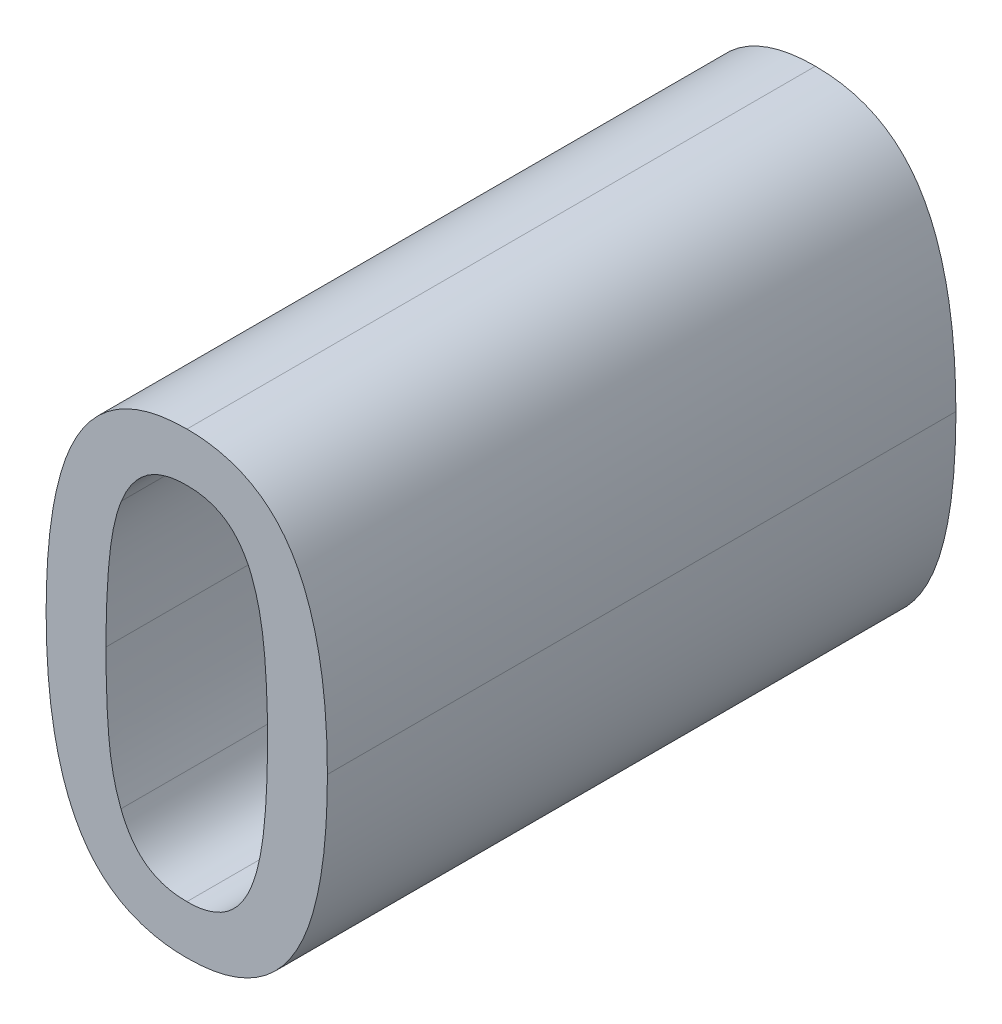
ISO-10303-21;
HEADER;
FILE_DESCRIPTION(('STEP AP214'),'2;1');
FILE_NAME('part.step','',(''),(''),'','','');
FILE_SCHEMA(('AUTOMOTIVE_DESIGN { 1 0 10303 214 1 1 1 1 }'));
ENDSEC;
DATA;
#1=APPLICATION_CONTEXT('core data for automotive mechanical design processes');
#2=APPLICATION_PROTOCOL_DEFINITION('international standard','automotive_design',2000,#1);
#3=PRODUCT_CONTEXT('',#1,'mechanical');
#4=PRODUCT('Part','Part','',(#3));
#5=PRODUCT_RELATED_PRODUCT_CATEGORY('part','',(#4));
#6=PRODUCT_DEFINITION_FORMATION('','',#4);
#7=PRODUCT_DEFINITION_CONTEXT('part definition',#1,'design');
#8=PRODUCT_DEFINITION('design','',#6,#7);
#9=PRODUCT_DEFINITION_SHAPE('','',#8);
#10=(LENGTH_UNIT() NAMED_UNIT(*) SI_UNIT(.MILLI.,.METRE.));
#11=(NAMED_UNIT(*) PLANE_ANGLE_UNIT() SI_UNIT($,.RADIAN.));
#12=(NAMED_UNIT(*) SI_UNIT($,.STERADIAN.) SOLID_ANGLE_UNIT());
#13=UNCERTAINTY_MEASURE_WITH_UNIT(LENGTH_MEASURE(1.E-05),#10,'distance_accuracy_value','');
#14=(GEOMETRIC_REPRESENTATION_CONTEXT(3) GLOBAL_UNCERTAINTY_ASSIGNED_CONTEXT((#13)) GLOBAL_UNIT_ASSIGNED_CONTEXT((#10,
#11,#12)) REPRESENTATION_CONTEXT('',''));
#15=CARTESIAN_POINT('',(0.,0.,0.));
#16=DIRECTION('',(0.,0.,1.));
#17=DIRECTION('',(1.,0.,0.));
#18=AXIS2_PLACEMENT_3D('',#15,#16,#17);
#19=CARTESIAN_POINT('',(0.909056419877411,-0.565618001030964,0.));
#20=CARTESIAN_POINT('',(0.909056419877411,-0.565618001030964,0.1));
#21=CARTESIAN_POINT('',(0.912913794388695,-0.565618001030964,0.));
#22=CARTESIAN_POINT('',(0.912913794388695,-0.565618001030964,0.1));
#23=CARTESIAN_POINT('',(0.917962416910818,-0.561930804806941,0.));
#24=CARTESIAN_POINT('',(0.917962416910818,-0.561930804806941,0.1));
#25=CARTESIAN_POINT('',(0.919380569304673,-0.558243608582919,0.));
#26=CARTESIAN_POINT('',(0.919380569304673,-0.558243608582919,0.1));
#27=B_SPLINE_SURFACE_WITH_KNOTS('',2,1,((#19,#20),(#21,#22),(#23,#24),(#25,#26)),.UNSPECIFIED.,
.F.,.F.,.F.,(3,1,3),(2,2),(0.,0.5,1.),(0.,1.),.UNSPECIFIED.);
#28=CARTESIAN_POINT('',(0.909056419877411,-0.565618001030964,0.));
#29=CARTESIAN_POINT('',(0.910267212618054,-0.56564585985134,0.));
#30=CARTESIAN_POINT('',(0.911517809576005,-0.565486872117512,0.));
#31=CARTESIAN_POINT('',(0.913610150242879,-0.564840726155343,0.));
#32=CARTESIAN_POINT('',(0.914479979941994,-0.564436955597001,0.));
#33=CARTESIAN_POINT('',(0.915996559710738,-0.563394993681676,0.));
#34=CARTESIAN_POINT('',(0.916652559078856,-0.562770086455742,0.));
#35=CARTESIAN_POINT('',(0.918164049922598,-0.560929138453409,0.));
#36=CARTESIAN_POINT('',(0.918882298702573,-0.559589516250247,0.));
#37=CARTESIAN_POINT('',(0.919380569609504,-0.558243607790358,0.));
#38=B_SPLINE_CURVE_WITH_KNOTS('',3,(#28,#29,#30,#31,#32,#33,#34,#35,#36,#37),.UNSPECIFIED.,.F.,
.F.,(4,2,2,2,4),(0.,0.00367627129055633,0.00651160113731828,0.00919946866098172,
0.0135916049079163),.UNSPECIFIED.);
#39=CARTESIAN_POINT('',(0.909056419877411,-0.565618001030964,0.));
#40=VERTEX_POINT('',#39);
#41=CARTESIAN_POINT('',(0.919380569304673,-0.558243608582919,0.));
#42=VERTEX_POINT('',#41);
#43=EDGE_CURVE('E11',#40,#42,#38,.T.);
#44=DIRECTION('',(0.,0.,1.));
#45=VECTOR('',#44,1.);
#46=CARTESIAN_POINT('',(0.909056419877411,-0.565618001030964,0.));
#47=LINE('',#46,#45);
#48=CARTESIAN_POINT('',(0.909056419877411,-0.565618001030964,0.1));
#49=VERTEX_POINT('',#48);
#50=EDGE_CURVE('E280',#40,#49,#47,.T.);
#51=CARTESIAN_POINT('',(0.919380569304673,-0.558243608582919,0.1));
#52=CARTESIAN_POINT('',(0.91892115176633,-0.5594846153821,0.1));
#53=CARTESIAN_POINT('',(0.918274116769871,-0.560720767791728,0.1));
#54=CARTESIAN_POINT('',(0.916816306298207,-0.562610601739669,0.1));
#55=CARTESIAN_POINT('',(0.916087707739882,-0.563332579650054,0.1));
#56=CARTESIAN_POINT('',(0.914518876125207,-0.56441007702488,0.1));
#57=CARTESIAN_POINT('',(0.913701486035512,-0.564798453941822,0.1));
#58=CARTESIAN_POINT('',(0.911621418659629,-0.56547445048266,0.1));
#59=CARTESIAN_POINT('',(0.91031785035809,-0.5656478711897,0.1));
#60=CARTESIAN_POINT('',(0.909056418304556,-0.565618001030964,0.1));
#61=B_SPLINE_CURVE_WITH_KNOTS('',3,(#51,#52,#53,#54,#55,#56,#57,#58,#59,#60),.UNSPECIFIED.,.F.,
.F.,(4,2,2,2,4),(0.,0.00405272402912058,0.00708561009471911,0.00976571674475608,
0.01359247812981),.UNSPECIFIED.);
#62=CARTESIAN_POINT('',(0.919380569304673,-0.558243608582919,0.1));
#63=VERTEX_POINT('',#62);
#64=EDGE_CURVE('E286',#63,#49,#61,.T.);
#65=DIRECTION('',(0.,0.,1.));
#66=VECTOR('',#65,1.);
#67=CARTESIAN_POINT('',(0.919380569304673,-0.558243608582919,0.));
#68=LINE('',#67,#66);
#69=EDGE_CURVE('E301',#42,#63,#68,.T.);
#70=ORIENTED_EDGE('',*,*,#43,.F.);
#71=ORIENTED_EDGE('',*,*,#50,.T.);
#72=ORIENTED_EDGE('',*,*,#64,.F.);
#73=ORIENTED_EDGE('',*,*,#69,.F.);
#74=EDGE_LOOP('',(#70,#71,#72,#73));
#75=FACE_BOUND('',#74,.T.);
#76=ADVANCED_FACE('F17',(#75),#27,.F.);
#77=CARTESIAN_POINT('',(0.898562092162886,-0.558073430295657,0.));
#78=CARTESIAN_POINT('',(0.898562092162886,-0.558073430295657,0.1));
#79=CARTESIAN_POINT('',(0.899923518460986,-0.561703900423925,0.));
#80=CARTESIAN_POINT('',(0.899923518460986,-0.561703900423925,0.1));
#81=CARTESIAN_POINT('',(0.904972140983109,-0.565618001030964,0.));
#82=CARTESIAN_POINT('',(0.904972140983109,-0.565618001030964,0.1));
#83=CARTESIAN_POINT('',(0.909056419877411,-0.565618001030964,0.));
#84=CARTESIAN_POINT('',(0.909056419877411,-0.565618001030964,0.1));
#85=B_SPLINE_SURFACE_WITH_KNOTS('',2,1,((#77,#78),(#79,#80),(#81,#82),(#83,#84)),.UNSPECIFIED.,
.F.,.F.,.F.,(3,1,3),(2,2),(0.,0.5,1.),(0.,1.),.UNSPECIFIED.);
#86=CARTESIAN_POINT('',(0.898562092162886,-0.558073430295657,0.));
#87=CARTESIAN_POINT('',(0.899032119665135,-0.559339515165096,0.));
#88=CARTESIAN_POINT('',(0.899688209514549,-0.560611801933779,0.));
#89=CARTESIAN_POINT('',(0.901181035793648,-0.562574355789389,0.));
#90=CARTESIAN_POINT('',(0.901937196437352,-0.563331055238074,0.));
#91=CARTESIAN_POINT('',(0.903515654761632,-0.564407176989134,0.));
#92=CARTESIAN_POINT('',(0.904299921514108,-0.564781559252794,0.));
#93=CARTESIAN_POINT('',(0.906389896997623,-0.565475146922471,0.));
#94=CARTESIAN_POINT('',(0.907747579413977,-0.565654104300062,0.));
#95=CARTESIAN_POINT('',(0.909056420833795,-0.565618001030964,0.));
#96=B_SPLINE_CURVE_WITH_KNOTS('',3,(#86,#87,#88,#89,#90,#91,#92,#93,#94,#95),.UNSPECIFIED.,.F.,
.F.,(4,2,2,2,4),(0.,0.0041518860493181,0.00731210362130394,0.00988844895489868,
0.0138631959958877),.UNSPECIFIED.);
#97=CARTESIAN_POINT('',(0.898562092162886,-0.558073430295657,0.));
#98=VERTEX_POINT('',#97);
#99=EDGE_CURVE('E32',#98,#40,#96,.T.);
#100=DIRECTION('',(0.,0.,1.));
#101=VECTOR('',#100,1.);
#102=CARTESIAN_POINT('',(0.898562092162886,-0.558073430295657,0.));
#103=LINE('',#102,#101);
#104=CARTESIAN_POINT('',(0.898562092162886,-0.558073430295657,0.1));
#105=VERTEX_POINT('',#104);
#106=EDGE_CURVE('E283',#98,#105,#103,.T.);
#107=CARTESIAN_POINT('',(0.909056419877411,-0.565618001030964,0.1));
#108=CARTESIAN_POINT('',(0.907832082284102,-0.565644099804821,0.1));
#109=CARTESIAN_POINT('',(0.906563208104373,-0.565492181139306,0.1));
#110=CARTESIAN_POINT('',(0.904470430436798,-0.564858879467396,0.1));
#111=CARTESIAN_POINT('',(0.903615282422973,-0.564470808694516,0.1));
#112=CARTESIAN_POINT('',(0.902147112098235,-0.56347849658322,0.1));
#113=CARTESIAN_POINT('',(0.901519381096472,-0.56289635787521,0.1));
#114=CARTESIAN_POINT('',(0.900273134187953,-0.561449758754844,0.1));
#115=CARTESIAN_POINT('',(0.899696771444867,-0.560551120310507,0.1));
#116=CARTESIAN_POINT('',(0.898975327909033,-0.559104501374176,0.1));
#117=CARTESIAN_POINT('',(0.898755405791218,-0.558592608690898,0.1));
#118=CARTESIAN_POINT('',(0.898562092162886,-0.558073430295657,0.1));
#119=B_SPLINE_CURVE_WITH_KNOTS('',3,(#107,#108,#109,#110,#111,#112,#113,#114,#115,#116,#117,
#118),.UNSPECIFIED.,.F.,.F.,(4,2,2,2,2,4),(0.,0.0037237069415342,0.00650317580725846,
0.00903732472947941,0.0122098264119718,0.013876051996284),.UNSPECIFIED.);
#120=EDGE_CURVE('E297',#49,#105,#119,.T.);
#121=ORIENTED_EDGE('',*,*,#99,.F.);
#122=ORIENTED_EDGE('',*,*,#106,.T.);
#123=ORIENTED_EDGE('',*,*,#120,.F.);
#124=ORIENTED_EDGE('',*,*,#50,.F.);
#125=EDGE_LOOP('',(#121,#122,#123,#124));
#126=FACE_BOUND('',#125,.T.);
#127=ADVANCED_FACE('F188',(#126),#85,.F.);
#128=CARTESIAN_POINT('',(0.89617959614121,-0.536971322675099,0.));
#129=CARTESIAN_POINT('',(0.89617959614121,-0.536971322675099,0.1));
#130=CARTESIAN_POINT('',(0.89617959614121,-0.544345715123143,0.));
#131=CARTESIAN_POINT('',(0.89617959614121,-0.544345715123143,0.1));
#132=CARTESIAN_POINT('',(0.897087213673277,-0.554216055784372,0.));
#133=CARTESIAN_POINT('',(0.897087213673277,-0.554216055784372,0.1));
#134=CARTESIAN_POINT('',(0.898562092162886,-0.558073430295657,0.));
#135=CARTESIAN_POINT('',(0.898562092162886,-0.558073430295657,0.1));
#136=B_SPLINE_SURFACE_WITH_KNOTS('',2,1,((#128,#129),(#130,#131),(#132,#133),(#134,#135)),
.UNSPECIFIED.,.F.,.F.,.F.,(3,1,3),(2,2),(0.,0.5,1.),(0.,1.),.UNSPECIFIED.);
#137=CARTESIAN_POINT('',(0.89617959614121,-0.536971322675099,0.));
#138=CARTESIAN_POINT('',(0.896194873233438,-0.53884873799181,0.));
#139=CARTESIAN_POINT('',(0.896207648918116,-0.540725879504751,0.));
#140=CARTESIAN_POINT('',(0.896304263461827,-0.544498327181554,0.));
#141=CARTESIAN_POINT('',(0.896388875830726,-0.546393608175672,0.));
#142=CARTESIAN_POINT('',(0.896718737311729,-0.55030462973275,0.));
#143=CARTESIAN_POINT('',(0.896974192968156,-0.552320088072961,0.));
#144=CARTESIAN_POINT('',(0.897710297002586,-0.555574594598394,0.));
#145=CARTESIAN_POINT('',(0.898081326156949,-0.556839262163063,0.));
#146=CARTESIAN_POINT('',(0.898562092162886,-0.558073430295657,0.));
#147=B_SPLINE_CURVE_WITH_KNOTS('',3,(#137,#138,#139,#140,#141,#142,#143,#144,#145,#146),
.UNSPECIFIED.,.F.,.F.,(4,2,2,2,4),(0.,0.00563106489923128,0.0113235433406714,0.0173907006261486,
0.021341740246364),.UNSPECIFIED.);
#148=CARTESIAN_POINT('',(0.89617959614121,-0.536971322675099,0.));
#149=VERTEX_POINT('',#148);
#150=EDGE_CURVE('E269',#149,#98,#147,.T.);
#151=DIRECTION('',(0.,0.,1.));
#152=VECTOR('',#151,1.);
#153=CARTESIAN_POINT('',(0.89617959614121,-0.536971322675099,0.));
#154=LINE('',#153,#152);
#155=CARTESIAN_POINT('',(0.89617959614121,-0.536971322675099,0.1));
#156=VERTEX_POINT('',#155);
#157=EDGE_CURVE('E295',#149,#156,#154,.T.);
#158=CARTESIAN_POINT('',(0.898562091555877,-0.558073428708094,0.1));
#159=CARTESIAN_POINT('',(0.897619885435836,-0.555713730085074,0.1));
#160=CARTESIAN_POINT('',(0.897108009175026,-0.553267049583408,0.1));
#161=CARTESIAN_POINT('',(0.896648783359491,-0.549582602822717,0.1));
#162=CARTESIAN_POINT('',(0.89654655609819,-0.548368076000775,0.1));
#163=CARTESIAN_POINT('',(0.896385762815465,-0.545934132954986,0.1));
#164=CARTESIAN_POINT('',(0.896327323103632,-0.544714712710028,0.1));
#165=CARTESIAN_POINT('',(0.896246020038301,-0.542405808700509,0.1));
#166=CARTESIAN_POINT('',(0.896220005459778,-0.541316460830288,0.1));
#167=CARTESIAN_POINT('',(0.896187034221754,-0.539141772819599,0.1));
#168=CARTESIAN_POINT('',(0.896180002550657,-0.53805643387904,0.1));
#169=CARTESIAN_POINT('',(0.89617959614121,-0.536971319377238,0.1));
#170=B_SPLINE_CURVE_WITH_KNOTS('',3,(#158,#159,#160,#161,#162,#163,#164,#165,#166,#167,#168,
#169),.UNSPECIFIED.,.F.,.F.,(4,2,2,2,2,4),(0.,0.00749383186341079,0.0111460824870698,
0.014808828259514,0.0180774928710397,0.0213332222076608),.UNSPECIFIED.);
#171=EDGE_CURVE('E313',#105,#156,#170,.T.);
#172=ORIENTED_EDGE('',*,*,#150,.F.);
#173=ORIENTED_EDGE('',*,*,#157,.T.);
#174=ORIENTED_EDGE('',*,*,#171,.F.);
#175=ORIENTED_EDGE('',*,*,#106,.F.);
#176=EDGE_LOOP('',(#172,#173,#174,#175));
#177=FACE_BOUND('',#176,.T.);
#178=ADVANCED_FACE('F184',(#177),#136,.F.);
#179=CARTESIAN_POINT('',(0.89861881825864,-0.515642310671524,0.));
#180=CARTESIAN_POINT('',(0.89861881825864,-0.515642310671524,0.1));
#181=CARTESIAN_POINT('',(0.897200665864785,-0.519216054704038,0.));
#182=CARTESIAN_POINT('',(0.897200665864785,-0.519216054704038,0.1));
#183=CARTESIAN_POINT('',(0.89617959614121,-0.530107465088842,0.));
#184=CARTESIAN_POINT('',(0.89617959614121,-0.530107465088842,0.1));
#185=CARTESIAN_POINT('',(0.89617959614121,-0.536971322675099,0.));
#186=CARTESIAN_POINT('',(0.89617959614121,-0.536971322675099,0.1));
#187=B_SPLINE_SURFACE_WITH_KNOTS('',2,1,((#179,#180),(#181,#182),(#183,#184),(#185,#186)),
.UNSPECIFIED.,.F.,.F.,.F.,(3,1,3),(2,2),(0.,0.5,1.),(0.,1.),.UNSPECIFIED.);
#188=CARTESIAN_POINT('',(0.89861881825864,-0.515642310671524,0.));
#189=CARTESIAN_POINT('',(0.898031046306757,-0.517148743595055,0.));
#190=CARTESIAN_POINT('',(0.897614147405343,-0.518699427183717,0.));
#191=CARTESIAN_POINT('',(0.89702101181466,-0.521738770929132,0.));
#192=CARTESIAN_POINT('',(0.896830234607591,-0.523224394187015,0.));
#193=CARTESIAN_POINT('',(0.896539833780557,-0.526207892924964,0.));
#194=CARTESIAN_POINT('',(0.896440637628606,-0.527705793263702,0.));
#195=CARTESIAN_POINT('',(0.896300351822083,-0.530502822811018,0.));
#196=CARTESIAN_POINT('',(0.896253243270168,-0.531801601963522,0.));
#197=CARTESIAN_POINT('',(0.896192439521179,-0.534390781325779,0.));
#198=CARTESIAN_POINT('',(0.896178510854828,-0.535681175979652,0.));
#199=CARTESIAN_POINT('',(0.89617959614121,-0.536971323085966,0.));
#200=B_SPLINE_CURVE_WITH_KNOTS('',3,(#188,#189,#190,#191,#192,#193,#194,#195,#196,#197,#198,
#199),.UNSPECIFIED.,.F.,.F.,(4,2,2,2,2,4),(0.,0.00481294322784697,0.0092959021811463,
0.0137996817476929,0.0176979814485385,0.0215687687894537),.UNSPECIFIED.);
#201=CARTESIAN_POINT('',(0.89861881825864,-0.515642310671524,0.));
#202=VERTEX_POINT('',#201);
#203=EDGE_CURVE('E261',#202,#149,#200,.T.);
#204=DIRECTION('',(0.,0.,1.));
#205=VECTOR('',#204,1.);
#206=CARTESIAN_POINT('',(0.89861881825864,-0.515642310671524,0.));
#207=LINE('',#206,#205);
#208=CARTESIAN_POINT('',(0.89861881825864,-0.515642310671524,0.1));
#209=VERTEX_POINT('',#208);
#210=EDGE_CURVE('E311',#202,#209,#207,.T.);
#211=CARTESIAN_POINT('',(0.89617959614121,-0.536971322675099,0.1));
#212=CARTESIAN_POINT('',(0.896194004259372,-0.534933190081441,0.1));
#213=CARTESIAN_POINT('',(0.896219468852487,-0.532899669430967,0.1));
#214=CARTESIAN_POINT('',(0.89636388344471,-0.528798250264312,0.1));
#215=CARTESIAN_POINT('',(0.896484583671533,-0.526730424946702,0.1));
#216=CARTESIAN_POINT('',(0.89694242620624,-0.522122615916438,0.1));
#217=CARTESIAN_POINT('',(0.897322550979549,-0.51958220680589,0.1));
#218=CARTESIAN_POINT('',(0.898245068639878,-0.516646441570645,0.1));
#219=CARTESIAN_POINT('',(0.898422306915657,-0.516141294179793,0.1));
#220=CARTESIAN_POINT('',(0.898618818079457,-0.515642311123066,0.1));
#221=B_SPLINE_CURVE_WITH_KNOTS('',3,(#211,#212,#213,#214,#215,#216,#217,#218,#219,#220),
.UNSPECIFIED.,.F.,.F.,(4,2,2,2,4),(0.,0.00610426386682868,0.012323400198396,0.0199569620334136,
0.0215627429597292),.UNSPECIFIED.);
#222=EDGE_CURVE('E325',#156,#209,#221,.T.);
#223=ORIENTED_EDGE('',*,*,#203,.F.);
#224=ORIENTED_EDGE('',*,*,#210,.T.);
#225=ORIENTED_EDGE('',*,*,#222,.F.);
#226=ORIENTED_EDGE('',*,*,#157,.F.);
#227=EDGE_LOOP('',(#223,#224,#225,#226));
#228=FACE_BOUND('',#227,.T.);
#229=ADVANCED_FACE('F333',(#228),#187,.F.);
#230=CARTESIAN_POINT('',(0.909056419877411,-0.508267918223479,0.));
#231=CARTESIAN_POINT('',(0.909056419877411,-0.508267918223479,0.1));
#232=CARTESIAN_POINT('',(0.905142319270372,-0.508267918223479,0.));
#233=CARTESIAN_POINT('',(0.905142319270372,-0.508267918223479,0.1));
#234=CARTESIAN_POINT('',(0.900093696748249,-0.511955114447502,0.));
#235=CARTESIAN_POINT('',(0.900093696748249,-0.511955114447502,0.1));
#236=CARTESIAN_POINT('',(0.89861881825864,-0.515642310671524,0.));
#237=CARTESIAN_POINT('',(0.89861881825864,-0.515642310671524,0.1));
#238=B_SPLINE_SURFACE_WITH_KNOTS('',2,1,((#230,#231),(#232,#233),(#234,#235),(#236,#237)),
.UNSPECIFIED.,.F.,.F.,.F.,(3,1,3),(2,2),(0.,0.5,1.),(0.,1.),.UNSPECIFIED.);
#239=CARTESIAN_POINT('',(0.909056419877411,-0.508267918223479,0.));
#240=CARTESIAN_POINT('',(0.907832883226709,-0.508239306336636,0.));
#241=CARTESIAN_POINT('',(0.906566526566882,-0.508397043854983,0.));
#242=CARTESIAN_POINT('',(0.904460776866591,-0.509042664637653,0.));
#243=CARTESIAN_POINT('',(0.903591741269283,-0.509442482814913,0.));
#244=CARTESIAN_POINT('',(0.902082481450094,-0.510471210344641,0.));
#245=CARTESIAN_POINT('',(0.901431479885625,-0.511084535821852,0.));
#246=CARTESIAN_POINT('',(0.899893132179646,-0.512924835247913,0.));
#247=CARTESIAN_POINT('',(0.899149255846495,-0.514284405438731,0.));
#248=CARTESIAN_POINT('',(0.898618817799568,-0.515642311819204,0.));
#249=B_SPLINE_CURVE_WITH_KNOTS('',3,(#239,#240,#241,#242,#243,#244,#245,#246,#247,#248),
.UNSPECIFIED.,.F.,.F.,(4,2,2,2,4),(0.,0.00371911329056871,0.00654798191926362,
0.00920305248145293,0.0136764398086563),.UNSPECIFIED.);
#250=CARTESIAN_POINT('',(0.909056419877411,-0.508267918223479,0.));
#251=VERTEX_POINT('',#250);
#252=EDGE_CURVE('E252',#251,#202,#249,.T.);
#253=DIRECTION('',(0.,0.,1.));
#254=VECTOR('',#253,1.);
#255=CARTESIAN_POINT('',(0.909056419877411,-0.508267918223479,0.));
#256=LINE('',#255,#254);
#257=CARTESIAN_POINT('',(0.909056419877411,-0.508267918223479,0.1));
#258=VERTEX_POINT('',#257);
#259=EDGE_CURVE('E323',#251,#258,#256,.T.);
#260=CARTESIAN_POINT('',(0.89861881825864,-0.515642310671524,0.1));
#261=CARTESIAN_POINT('',(0.899107737773357,-0.514384539385591,0.1));
#262=CARTESIAN_POINT('',(0.899783016327358,-0.513125930253331,0.1));
#263=CARTESIAN_POINT('',(0.901286941544007,-0.511219034021222,0.1));
#264=CARTESIAN_POINT('',(0.902029592040893,-0.51049718749248,0.1));
#265=CARTESIAN_POINT('',(0.903613006585649,-0.509436782151373,0.1));
#266=CARTESIAN_POINT('',(0.904428019299753,-0.509060298540741,0.1));
#267=CARTESIAN_POINT('',(0.906502636192756,-0.508405274531867,0.1));
#268=CARTESIAN_POINT('',(0.907801884146269,-0.508239824841691,0.1));
#269=CARTESIAN_POINT('',(0.909056422085536,-0.508267918223479,0.1));
#270=B_SPLINE_CURVE_WITH_KNOTS('',3,(#260,#261,#262,#263,#264,#265,#266,#267,#268,#269),
.UNSPECIFIED.,.F.,.F.,(4,2,2,2,4),(0.,0.00414363781747205,0.00720606109413408,
0.00986569948818214,0.0136775556327739),.UNSPECIFIED.);
#271=EDGE_CURVE('E536',#209,#258,#270,.T.);
#272=ORIENTED_EDGE('',*,*,#252,.F.);
#273=ORIENTED_EDGE('',*,*,#259,.T.);
#274=ORIENTED_EDGE('',*,*,#271,.F.);
#275=ORIENTED_EDGE('',*,*,#210,.F.);
#276=EDGE_LOOP('',(#272,#273,#274,#275));
#277=FACE_BOUND('',#276,.T.);
#278=ADVANCED_FACE('F338',(#277),#238,.F.);
#279=CARTESIAN_POINT('',(0.919323843208919,-0.515528858480016,0.));
#280=CARTESIAN_POINT('',(0.919323843208919,-0.515528858480016,0.1));
#281=CARTESIAN_POINT('',(0.917905690815064,-0.511955114447502,0.));
#282=CARTESIAN_POINT('',(0.917905690815064,-0.511955114447502,0.1));
#283=CARTESIAN_POINT('',(0.91297052048445,-0.508267918223479,0.));
#284=CARTESIAN_POINT('',(0.91297052048445,-0.508267918223479,0.1));
#285=CARTESIAN_POINT('',(0.909056419877411,-0.508267918223479,0.));
#286=CARTESIAN_POINT('',(0.909056419877411,-0.508267918223479,0.1));
#287=B_SPLINE_SURFACE_WITH_KNOTS('',2,1,((#279,#280),(#281,#282),(#283,#284),(#285,#286)),
.UNSPECIFIED.,.F.,.F.,.F.,(3,1,3),(2,2),(0.,0.5,1.),(0.,1.),.UNSPECIFIED.);
#288=CARTESIAN_POINT('',(0.919323843208919,-0.515528858480016,0.));
#289=CARTESIAN_POINT('',(0.918841424255359,-0.514290821503638,0.));
#290=CARTESIAN_POINT('',(0.918177009157526,-0.513048195557504,0.));
#291=CARTESIAN_POINT('',(0.916691897149138,-0.511159017303144,0.));
#292=CARTESIAN_POINT('',(0.915954513674292,-0.51044128791765,0.));
#293=CARTESIAN_POINT('',(0.914402092269571,-0.509407363334264,0.));
#294=CARTESIAN_POINT('',(0.913617874990826,-0.509045562826433,0.));
#295=CARTESIAN_POINT('',(0.911587403907191,-0.508401412966769,0.));
#296=CARTESIAN_POINT('',(0.910298773694492,-0.508238661104177,0.));
#297=CARTESIAN_POINT('',(0.909056417731781,-0.508267918223479,0.));
#298=B_SPLINE_CURVE_WITH_KNOTS('',3,(#288,#289,#290,#291,#292,#293,#294,#295,#296,#297),
.UNSPECIFIED.,.F.,.F.,(4,2,2,2,4),(0.,0.00408557681685786,0.00712720430449132,
0.00968685410316085,0.0134637097217617),.UNSPECIFIED.);
#299=CARTESIAN_POINT('',(0.919323843208919,-0.515528858480015,0.));
#300=VERTEX_POINT('',#299);
#301=EDGE_CURVE('E242',#300,#251,#298,.T.);
#302=DIRECTION('',(0.,0.,1.));
#303=VECTOR('',#302,1.);
#304=CARTESIAN_POINT('',(0.919323843208919,-0.515528858480015,0.));
#305=LINE('',#304,#303);
#306=CARTESIAN_POINT('',(0.919323843208919,-0.515528858480015,0.1));
#307=VERTEX_POINT('',#306);
#308=EDGE_CURVE('E542',#300,#307,#305,.T.);
#309=CARTESIAN_POINT('',(0.909056419877411,-0.508267918223479,0.1));
#310=CARTESIAN_POINT('',(0.910259154175548,-0.50824185010978,0.1));
#311=CARTESIAN_POINT('',(0.911503862700689,-0.508392475134528,0.1));
#312=CARTESIAN_POINT('',(0.913561740690884,-0.509017413826974,0.1));
#313=CARTESIAN_POINT('',(0.91440508437197,-0.509401566835123,0.1));
#314=CARTESIAN_POINT('',(0.915861575069871,-0.510387804708538,0.1));
#315=CARTESIAN_POINT('',(0.916487474386578,-0.51097075545736,0.1));
#316=CARTESIAN_POINT('',(0.917729066716048,-0.512424410672821,0.1));
#317=CARTESIAN_POINT('',(0.918300559597565,-0.513330555757778,0.1));
#318=CARTESIAN_POINT('',(0.918973747107039,-0.514691378746413,0.1));
#319=CARTESIAN_POINT('',(0.919157166041113,-0.515107765746901,0.1));
#320=CARTESIAN_POINT('',(0.919323843363009,-0.515528858868323,0.1));
#321=B_SPLINE_CURVE_WITH_KNOTS('',3,(#309,#310,#311,#312,#313,#314,#315,#316,#317,#318,#319,
#320),.UNSPECIFIED.,.F.,.F.,(4,2,2,2,2,4),(0.,0.00365494250347632,0.00639775786631591,
0.00892862720587757,0.0121117353200126,0.0134738121228435),.UNSPECIFIED.);
#322=EDGE_CURVE('E549',#258,#307,#321,.T.);
#323=ORIENTED_EDGE('',*,*,#301,.F.);
#324=ORIENTED_EDGE('',*,*,#308,.T.);
#325=ORIENTED_EDGE('',*,*,#322,.F.);
#326=ORIENTED_EDGE('',*,*,#259,.F.);
#327=EDGE_LOOP('',(#323,#324,#325,#326));
#328=FACE_BOUND('',#327,.T.);
#329=ADVANCED_FACE('F350',(#328),#287,.F.);
#330=CARTESIAN_POINT('',(0.921876517517857,-0.536914596579344,0.));
#331=CARTESIAN_POINT('',(0.921876517517857,-0.536914596579344,0.1));
#332=CARTESIAN_POINT('',(0.921876517517857,-0.529710382418563,0.));
#333=CARTESIAN_POINT('',(0.921876517517857,-0.529710382418563,0.1));
#334=CARTESIAN_POINT('',(0.920741995602773,-0.519102602512529,0.));
#335=CARTESIAN_POINT('',(0.920741995602773,-0.519102602512529,0.1));
#336=CARTESIAN_POINT('',(0.919323843208919,-0.515528858480016,0.));
#337=CARTESIAN_POINT('',(0.919323843208919,-0.515528858480016,0.1));
#338=B_SPLINE_SURFACE_WITH_KNOTS('',2,1,((#330,#331),(#332,#333),(#334,#335),(#336,#337)),
.UNSPECIFIED.,.F.,.F.,.F.,(3,1,3),(2,2),(0.,0.5,1.),(0.,1.),.UNSPECIFIED.);
#339=CARTESIAN_POINT('',(0.921876517517857,-0.536914596579344,0.));
#340=CARTESIAN_POINT('',(0.921862699575506,-0.534819204641769,0.));
#341=CARTESIAN_POINT('',(0.921835618889062,-0.532721164042988,0.));
#342=CARTESIAN_POINT('',(0.921672824934347,-0.528548454955608,0.));
#343=CARTESIAN_POINT('',(0.921538066634549,-0.526473742881887,0.));
#344=CARTESIAN_POINT('',(0.921142509484469,-0.522899968056074,0.));
#345=CARTESIAN_POINT('',(0.920925812676562,-0.521397406440382,0.));
#346=CARTESIAN_POINT('',(0.920296792973233,-0.518426036426168,0.));
#347=CARTESIAN_POINT('',(0.91988322733535,-0.516957505486398,0.));
#348=CARTESIAN_POINT('',(0.919323843208919,-0.515528858480016,0.));
#349=B_SPLINE_CURVE_WITH_KNOTS('',3,(#339,#340,#341,#342,#343,#344,#345,#346,#347,#348),
.UNSPECIFIED.,.F.,.F.,(4,2,2,2,4),(0.,0.00629017370473222,0.0125251723313668,0.0170689748382148,
0.0216418485253573),.UNSPECIFIED.);
#350=CARTESIAN_POINT('',(0.921876517517857,-0.536914596579344,0.));
#351=VERTEX_POINT('',#350);
#352=EDGE_CURVE('E232',#351,#300,#349,.T.);
#353=DIRECTION('',(0.,0.,1.));
#354=VECTOR('',#353,1.);
#355=CARTESIAN_POINT('',(0.921876517517857,-0.536914596579344,0.));
#356=LINE('',#355,#354);
#357=CARTESIAN_POINT('',(0.921876517517857,-0.536914596579344,0.1));
#358=VERTEX_POINT('',#357);
#359=EDGE_CURVE('E547',#351,#358,#356,.T.);
#360=CARTESIAN_POINT('',(0.919323843208919,-0.515528858480016,0.1));
#361=CARTESIAN_POINT('',(0.919956533252805,-0.517150544932344,0.1));
#362=CARTESIAN_POINT('',(0.920404601706404,-0.518821167217804,0.1));
#363=CARTESIAN_POINT('',(0.920998418025033,-0.521875178361576,0.1));
#364=CARTESIAN_POINT('',(0.921186513577248,-0.523249781072846,0.1));
#365=CARTESIAN_POINT('',(0.921479204909422,-0.52601083671169,0.1));
#366=CARTESIAN_POINT('',(0.92158347311231,-0.527397314934846,0.1));
#367=CARTESIAN_POINT('',(0.921740244106454,-0.530142980892757,0.1));
#368=CARTESIAN_POINT('',(0.921793825907646,-0.531502104596605,0.1));
#369=CARTESIAN_POINT('',(0.92186187179864,-0.534212486112993,0.1));
#370=CARTESIAN_POINT('',(0.921876589186825,-0.535563737298348,0.1));
#371=CARTESIAN_POINT('',(0.921876517517857,-0.53691459659313,0.1));
#372=B_SPLINE_CURVE_WITH_KNOTS('',3,(#360,#361,#362,#363,#364,#365,#366,#367,#368,#369,#370,
#371),.UNSPECIFIED.,.F.,.F.,(4,2,2,2,2,4),(0.,0.00518308595621303,0.00933766433958814,
0.0135083999584874,0.0175882067942438,0.0216413571455842),.UNSPECIFIED.);
#373=EDGE_CURVE('E510',#307,#358,#372,.T.);
#374=ORIENTED_EDGE('',*,*,#352,.F.);
#375=ORIENTED_EDGE('',*,*,#359,.T.);
#376=ORIENTED_EDGE('',*,*,#373,.F.);
#377=ORIENTED_EDGE('',*,*,#308,.F.);
#378=EDGE_LOOP('',(#374,#375,#376,#377));
#379=FACE_BOUND('',#378,.T.);
#380=ADVANCED_FACE('F388',(#379),#338,.F.);
#381=CARTESIAN_POINT('',(0.919380569304673,-0.558243608582919,0.));
#382=CARTESIAN_POINT('',(0.919380569304673,-0.558243608582919,0.1));
#383=CARTESIAN_POINT('',(0.920741995602773,-0.554783316741914,0.));
#384=CARTESIAN_POINT('',(0.920741995602773,-0.554783316741914,0.1));
#385=CARTESIAN_POINT('',(0.921876517517857,-0.544118810740126,0.));
#386=CARTESIAN_POINT('',(0.921876517517857,-0.544118810740126,0.1));
#387=CARTESIAN_POINT('',(0.921876517517857,-0.536914596579344,0.));
#388=CARTESIAN_POINT('',(0.921876517517857,-0.536914596579344,0.1));
#389=B_SPLINE_SURFACE_WITH_KNOTS('',2,1,((#381,#382),(#383,#384),(#385,#386),(#387,#388)),
.UNSPECIFIED.,.F.,.F.,.F.,(3,1,3),(2,2),(0.,0.5,1.),(0.,1.),.UNSPECIFIED.);
#390=CARTESIAN_POINT('',(0.919380569304673,-0.558243608582919,0.));
#391=CARTESIAN_POINT('',(0.919929803171767,-0.556790091453295,0.));
#392=CARTESIAN_POINT('',(0.920340586132928,-0.555302365076531,0.));
#393=CARTESIAN_POINT('',(0.921176235825019,-0.551276486701793,0.));
#394=CARTESIAN_POINT('',(0.921426945337065,-0.548700972419795,0.));
#395=CARTESIAN_POINT('',(0.921696473523841,-0.544587428274117,0.));
#396=CARTESIAN_POINT('',(0.921767959080188,-0.543047279374597,0.));
#397=CARTESIAN_POINT('',(0.921858845550004,-0.539977182889885,0.));
#398=CARTESIAN_POINT('',(0.921878640674745,-0.538447247384185,0.));
#399=CARTESIAN_POINT('',(0.921876517517857,-0.536914596579344,0.));
#400=B_SPLINE_CURVE_WITH_KNOTS('',3,(#390,#391,#392,#393,#394,#395,#396,#397,#398,#399),
.UNSPECIFIED.,.F.,.F.,(4,2,2,2,4),(0.,0.00462846651776826,0.0123510326061647,0.0169786013255341,
0.0215707739298269),.UNSPECIFIED.);
#401=EDGE_CURVE('E222',#42,#351,#400,.T.);
#402=CARTESIAN_POINT('',(0.921876517517857,-0.536914596579344,0.1));
#403=CARTESIAN_POINT('',(0.921865977025306,-0.538991245732768,0.1));
#404=CARTESIAN_POINT('',(0.921837819204782,-0.541064366234426,0.1));
#405=CARTESIAN_POINT('',(0.921674645215005,-0.545242493892178,0.1));
#406=CARTESIAN_POINT('',(0.921537745792492,-0.547347415686658,0.1));
#407=CARTESIAN_POINT('',(0.921039409470211,-0.551935484125581,0.1));
#408=CARTESIAN_POINT('',(0.920641815248203,-0.554418127929893,0.1));
#409=CARTESIAN_POINT('',(0.919736244997155,-0.557281514550877,0.1));
#410=CARTESIAN_POINT('',(0.919566861217211,-0.557765295480145,0.1));
#411=CARTESIAN_POINT('',(0.919380569304673,-0.558243608582919,0.1));
#412=B_SPLINE_CURVE_WITH_KNOTS('',3,(#402,#403,#404,#405,#406,#407,#408,#409,#410,#411),
.UNSPECIFIED.,.F.,.F.,(4,2,2,2,4),(0.,0.00622164990616539,0.0125534631009703,0.0200313707004765,
0.0215688827657875),.UNSPECIFIED.);
#413=EDGE_CURVE('E509',#358,#63,#412,.T.);
#414=ORIENTED_EDGE('',*,*,#401,.F.);
#415=ORIENTED_EDGE('',*,*,#69,.T.);
#416=ORIENTED_EDGE('',*,*,#413,.F.);
#417=ORIENTED_EDGE('',*,*,#359,.F.);
#418=EDGE_LOOP('',(#414,#415,#416,#417));
#419=FACE_BOUND('',#418,.T.);
#420=ADVANCED_FACE('F398',(#419),#389,.F.);
#421=CARTESIAN_POINT('',(0.886649612054506,-0.536971322675099,0.));
#422=CARTESIAN_POINT('',(0.886649612054506,-0.536971322675099,0.1));
#423=CARTESIAN_POINT('',(0.886649612054506,-0.55540730379521,0.));
#424=CARTESIAN_POINT('',(0.886649612054506,-0.55540730379521,0.1));
#425=CARTESIAN_POINT('',(0.897484296343556,-0.573389476149288,0.));
#426=CARTESIAN_POINT('',(0.897484296343556,-0.573389476149288,0.1));
#427=CARTESIAN_POINT('',(0.909056419877411,-0.573389476149288,0.));
#428=CARTESIAN_POINT('',(0.909056419877411,-0.573389476149288,0.1));
#429=B_SPLINE_SURFACE_WITH_KNOTS('',2,1,((#421,#422),(#423,#424),(#425,#426),(#427,#428)),
.UNSPECIFIED.,.F.,.F.,.F.,(3,1,3),(2,2),(0.,0.5,1.),(0.,1.),.UNSPECIFIED.);
#430=CARTESIAN_POINT('',(0.909056419877411,-0.573389476149288,0.));
#431=CARTESIAN_POINT('',(0.907890852423064,-0.573388318546546,0.));
#432=CARTESIAN_POINT('',(0.906720845525969,-0.573320362126548,0.));
#433=CARTESIAN_POINT('',(0.904395929277159,-0.573011057834506,0.));
#434=CARTESIAN_POINT('',(0.903241204269014,-0.572768385533776,0.));
#435=CARTESIAN_POINT('',(0.900358393248333,-0.571872477750939,0.));
#436=CARTESIAN_POINT('',(0.898671915350949,-0.57106531962612,0.));
#437=CARTESIAN_POINT('',(0.895724419576033,-0.568979696727351,0.));
#438=CARTESIAN_POINT('',(0.894449268940298,-0.567721031870001,0.));
#439=CARTESIAN_POINT('',(0.892126019323109,-0.564696002487542,0.));
#440=CARTESIAN_POINT('',(0.891145203320874,-0.562880917410735,0.));
#441=CARTESIAN_POINT('',(0.889316241347197,-0.558540263787723,0.));
#442=CARTESIAN_POINT('',(0.888597725864948,-0.555965730707562,0.));
#443=CARTESIAN_POINT('',(0.887514734451407,-0.550649374545319,0.));
#444=CARTESIAN_POINT('',(0.887165363094041,-0.547904960330965,0.));
#445=CARTESIAN_POINT('',(0.886740246875641,-0.542426952473494,0.));
#446=CARTESIAN_POINT('',(0.886661176913422,-0.539693643588004,0.));
#447=CARTESIAN_POINT('',(0.886649612054506,-0.53697132266283,0.));
#448=B_SPLINE_CURVE_WITH_KNOTS('',3,(#430,#431,#432,#433,#434,#435,#436,#437,#438,#439,#440,
#441,#442,#443,#444,#445,#446,#447),.UNSPECIFIED.,.F.,.F.,(4,2,2,2,2,2,2,2,4),(0.,
0.00350071759884081,0.007028255519441,0.0125339967820719,0.0178230441150336,0.0239441960884799,
0.031914862676616,0.04020035018098,0.0483835400245915),.UNSPECIFIED.);
#449=CARTESIAN_POINT('',(0.909056419877411,-0.573389476149288,0.));
#450=VERTEX_POINT('',#449);
#451=CARTESIAN_POINT('',(0.886649612054506,-0.536971322675099,0.));
#452=VERTEX_POINT('',#451);
#453=EDGE_CURVE('E214',#450,#452,#448,.T.);
#454=DIRECTION('',(0.,0.,1.));
#455=VECTOR('',#454,1.);
#456=CARTESIAN_POINT('',(0.909056419877411,-0.573389476149288,0.));
#457=LINE('',#456,#455);
#458=CARTESIAN_POINT('',(0.909056419877411,-0.573389476149288,0.1));
#459=VERTEX_POINT('',#458);
#460=EDGE_CURVE('E508',#450,#459,#457,.T.);
#461=CARTESIAN_POINT('',(0.886649612054506,-0.536971322675099,0.1));
#462=CARTESIAN_POINT('',(0.886662675829364,-0.539708005071806,0.1));
#463=CARTESIAN_POINT('',(0.886742016332733,-0.542460183024563,0.1));
#464=CARTESIAN_POINT('',(0.887173792939731,-0.548000759149311,0.1));
#465=CARTESIAN_POINT('',(0.887532103651447,-0.550788651703692,0.1));
#466=CARTESIAN_POINT('',(0.888431413699495,-0.555115918281971,0.1));
#467=CARTESIAN_POINT('',(0.88883018494018,-0.556682658796431,0.1));
#468=CARTESIAN_POINT('',(0.889817465265829,-0.559747322921082,0.1));
#469=CARTESIAN_POINT('',(0.890405006614257,-0.561245553934201,0.1));
#470=CARTESIAN_POINT('',(0.892057009271033,-0.564541637416504,0.1));
#471=CARTESIAN_POINT('',(0.893210363945031,-0.566300383878198,0.1));
#472=CARTESIAN_POINT('',(0.895869759983518,-0.569101042576281,0.1));
#473=CARTESIAN_POINT('',(0.897302974364083,-0.570209117505332,0.1));
#474=CARTESIAN_POINT('',(0.900459466226426,-0.571922542749731,0.1));
#475=CARTESIAN_POINT('',(0.902186721192397,-0.572520213311515,0.1));
#476=CARTESIAN_POINT('',(0.905641944511699,-0.573247513109353,0.1));
#477=CARTESIAN_POINT('',(0.907364709420458,-0.573400948107975,0.1));
#478=CARTESIAN_POINT('',(0.909056424645564,-0.573389476149288,0.1));
#479=B_SPLINE_CURVE_WITH_KNOTS('',3,(#461,#462,#463,#464,#465,#466,#467,#468,#469,#470,#471,
#472,#473,#474,#475,#476,#477,#478),.UNSPECIFIED.,.F.,.F.,(4,2,2,2,2,2,2,2,4),(0.,
0.00823517120707137,0.0166486117916583,0.0214886620242436,0.0263042852214529,0.032516396867585,
0.037851059087157,0.0432646415987829,0.0483822061985135),.UNSPECIFIED.);
#480=CARTESIAN_POINT('',(0.886649612054506,-0.536971322675099,0.1));
#481=VERTEX_POINT('',#480);
#482=EDGE_CURVE('E135',#481,#459,#479,.T.);
#483=DIRECTION('',(0.,0.,1.));
#484=VECTOR('',#483,1.);
#485=CARTESIAN_POINT('',(0.886649612054506,-0.536971322675099,0.));
#486=LINE('',#485,#484);
#487=EDGE_CURVE('E506',#452,#481,#486,.T.);
#488=ORIENTED_EDGE('',*,*,#453,.F.);
#489=ORIENTED_EDGE('',*,*,#460,.T.);
#490=ORIENTED_EDGE('',*,*,#482,.F.);
#491=ORIENTED_EDGE('',*,*,#487,.F.);
#492=EDGE_LOOP('',(#488,#489,#490,#491));
#493=FACE_BOUND('',#492,.T.);
#494=ADVANCED_FACE('F408',(#493),#429,.T.);
#495=CARTESIAN_POINT('',(0.909056419877411,-0.500496443105156,0.));
#496=CARTESIAN_POINT('',(0.909056419877411,-0.500496443105156,0.1));
#497=CARTESIAN_POINT('',(0.897597748535065,-0.500496443105156,0.));
#498=CARTESIAN_POINT('',(0.897597748535065,-0.500496443105156,0.1));
#499=CARTESIAN_POINT('',(0.886649612054506,-0.5180248066932,0.));
#500=CARTESIAN_POINT('',(0.886649612054506,-0.5180248066932,0.1));
#501=CARTESIAN_POINT('',(0.886649612054506,-0.536971322675099,0.));
#502=CARTESIAN_POINT('',(0.886649612054506,-0.536971322675099,0.1));
#503=B_SPLINE_SURFACE_WITH_KNOTS('',2,1,((#495,#496),(#497,#498),(#499,#500),(#501,#502)),
.UNSPECIFIED.,.F.,.F.,.F.,(3,1,3),(2,2),(0.,0.5,1.),(0.,1.),.UNSPECIFIED.);
#504=CARTESIAN_POINT('',(0.886649612054506,-0.536971322675099,0.));
#505=CARTESIAN_POINT('',(0.886663043922747,-0.534255647571089,0.));
#506=CARTESIAN_POINT('',(0.886736959086568,-0.531525259418533,0.));
#507=CARTESIAN_POINT('',(0.887144261087042,-0.526025037593948,0.));
#508=CARTESIAN_POINT('',(0.887483371611131,-0.523255673826292,0.));
#509=CARTESIAN_POINT('',(0.888335025408274,-0.518978678458007,0.));
#510=CARTESIAN_POINT('',(0.888708325581681,-0.517445325089083,0.));
#511=CARTESIAN_POINT('',(0.889634199175338,-0.514441272069123,0.));
#512=CARTESIAN_POINT('',(0.8901858058928,-0.512970281890293,0.));
#513=CARTESIAN_POINT('',(0.891754330303239,-0.509713302139117,0.));
#514=CARTESIAN_POINT('',(0.892861363293743,-0.507965911670265,0.));
#515=CARTESIAN_POINT('',(0.895442712278337,-0.505113709706364,0.));
#516=CARTESIAN_POINT('',(0.896856914793724,-0.503956916565064,0.));
#517=CARTESIAN_POINT('',(0.899979223239875,-0.502156557723116,0.));
#518=CARTESIAN_POINT('',(0.901688694645667,-0.501515458460872,0.));
#519=CARTESIAN_POINT('',(0.905294109117266,-0.500667175092145,0.));
#520=CARTESIAN_POINT('',(0.907194870661858,-0.500479371135044,0.));
#521=CARTESIAN_POINT('',(0.909056422772518,-0.500496443105156,0.));
#522=B_SPLINE_CURVE_WITH_KNOTS('',3,(#504,#505,#506,#507,#508,#509,#510,#511,#512,#513,#514,
#515,#516,#517,#518,#519,#520,#521),.UNSPECIFIED.,.F.,.F.,(4,2,2,2,2,2,2,2,4),(0.,
0.00817108783180746,0.0165235688586088,0.0212492916842199,0.0259498116736566,0.032066346965673,
0.0374479489347573,0.0428551392591423,0.048489706633696),.UNSPECIFIED.);
#523=CARTESIAN_POINT('',(0.909056419877411,-0.500496443105156,0.));
#524=VERTEX_POINT('',#523);
#525=EDGE_CURVE('E205',#452,#524,#522,.T.);
#526=CARTESIAN_POINT('',(0.909056419877411,-0.500496443105156,0.1));
#527=CARTESIAN_POINT('',(0.907883333978929,-0.500497626746091,0.1));
#528=CARTESIAN_POINT('',(0.906705747310055,-0.500566060912786,0.1));
#529=CARTESIAN_POINT('',(0.904365988351615,-0.500877412616015,0.1));
#530=CARTESIAN_POINT('',(0.903203997154142,-0.501121630966029,0.1));
#531=CARTESIAN_POINT('',(0.900301573132221,-0.502023588998583,0.1));
#532=CARTESIAN_POINT('',(0.898603176868318,-0.502836614310833,0.1));
#533=CARTESIAN_POINT('',(0.895632720888884,-0.504936585016694,0.1));
#534=CARTESIAN_POINT('',(0.894346683255579,-0.506203931304945,0.1));
#535=CARTESIAN_POINT('',(0.89203266374349,-0.509217842738531,0.1));
#536=CARTESIAN_POINT('',(0.891061355908713,-0.511005631428193,0.1));
#537=CARTESIAN_POINT('',(0.88926859524827,-0.515272488801497,0.1));
#538=CARTESIAN_POINT('',(0.888575592052688,-0.517800046211355,0.1));
#539=CARTESIAN_POINT('',(0.887506743140349,-0.523108252525252,0.1));
#540=CARTESIAN_POINT('',(0.887158992178978,-0.525893540932743,0.1));
#541=CARTESIAN_POINT('',(0.886738378240721,-0.531446741203519,0.1));
#542=CARTESIAN_POINT('',(0.886661635009548,-0.534214327159093,0.1));
#543=CARTESIAN_POINT('',(0.886649612054506,-0.536971325626668,0.1));
#544=B_SPLINE_CURVE_WITH_KNOTS('',3,(#526,#527,#528,#529,#530,#531,#532,#533,#534,#535,#536,
#537,#538,#539,#540,#541,#542,#543),.UNSPECIFIED.,.F.,.F.,(4,2,2,2,2,2,2,2,4),(0.,
0.00352336786679624,0.00707308050704778,0.0126182818349188,0.0179484631262574,
0.0239840356426366,0.0317977158484881,0.0402050138194261,0.0484914378708692),.UNSPECIFIED.);
#545=CARTESIAN_POINT('',(0.909056419877411,-0.500496443105156,0.1));
#546=VERTEX_POINT('',#545);
#547=EDGE_CURVE('E121',#546,#481,#544,.T.);
#548=DIRECTION('',(0.,0.,1.));
#549=VECTOR('',#548,1.);
#550=CARTESIAN_POINT('',(0.909056419877411,-0.500496443105156,0.));
#551=LINE('',#550,#549);
#552=EDGE_CURVE('E127',#524,#546,#551,.T.);
#553=ORIENTED_EDGE('',*,*,#525,.F.);
#554=ORIENTED_EDGE('',*,*,#487,.T.);
#555=ORIENTED_EDGE('',*,*,#547,.F.);
#556=ORIENTED_EDGE('',*,*,#552,.F.);
#557=EDGE_LOOP('',(#553,#554,#555,#556));
#558=FACE_BOUND('',#557,.T.);
#559=ADVANCED_FACE('F417',(#558),#503,.T.);
#560=CARTESIAN_POINT('',(0.931406501604561,-0.536914596579344,0.));
#561=CARTESIAN_POINT('',(0.931406501604561,-0.536914596579344,0.1));
#562=CARTESIAN_POINT('',(0.931406501604561,-0.518648793746496,0.));
#563=CARTESIAN_POINT('',(0.931406501604561,-0.518648793746496,0.1));
#564=CARTESIAN_POINT('',(0.920571817315511,-0.500496443105156,0.));
#565=CARTESIAN_POINT('',(0.920571817315511,-0.500496443105156,0.1));
#566=CARTESIAN_POINT('',(0.909056419877411,-0.500496443105156,0.));
#567=CARTESIAN_POINT('',(0.909056419877411,-0.500496443105156,0.1));
#568=B_SPLINE_SURFACE_WITH_KNOTS('',2,1,((#560,#561),(#562,#563),(#564,#565),(#566,#567)),
.UNSPECIFIED.,.F.,.F.,.F.,(3,1,3),(2,2),(0.,0.5,1.),(0.,1.),.UNSPECIFIED.);
#569=CARTESIAN_POINT('',(0.909056419877411,-0.500496443105156,0.));
#570=CARTESIAN_POINT('',(0.910208585158108,-0.500497469689223,0.));
#571=CARTESIAN_POINT('',(0.911365083339336,-0.500565269653021,0.));
#572=CARTESIAN_POINT('',(0.913662492420515,-0.50087285006552,0.));
#573=CARTESIAN_POINT('',(0.914803228914602,-0.501113877028624,0.));
#574=CARTESIAN_POINT('',(0.917661602736625,-0.502005287757174,0.));
#575=CARTESIAN_POINT('',(0.919337041465236,-0.502810770763564,0.));
#576=CARTESIAN_POINT('',(0.922274399330168,-0.50489348875043,0.));
#577=CARTESIAN_POINT('',(0.923548283812779,-0.506154028821211,0.));
#578=CARTESIAN_POINT('',(0.925876442896842,-0.509185548966608,0.));
#579=CARTESIAN_POINT('',(0.92686223398404,-0.511006052970864,0.));
#580=CARTESIAN_POINT('',(0.928711283692072,-0.515372297815922,0.));
#581=CARTESIAN_POINT('',(0.929442540517075,-0.517968305129825,0.));
#582=CARTESIAN_POINT('',(0.93053513286901,-0.523294425941101,0.));
#583=CARTESIAN_POINT('',(0.930886488755319,-0.52602627131184,0.));
#584=CARTESIAN_POINT('',(0.931314910096955,-0.531480790513215,0.));
#585=CARTESIAN_POINT('',(0.931395192355797,-0.534203186102685,0.));
#586=CARTESIAN_POINT('',(0.931406501604561,-0.536914596750695,0.));
#587=B_SPLINE_CURVE_WITH_KNOTS('',3,(#569,#570,#571,#572,#573,#574,#575,#576,#577,#578,#579,
#580,#581,#582,#583,#584,#585,#586),.UNSPECIFIED.,.F.,.F.,(4,2,2,2,2,2,2,2,4),(0.,
0.00346034070696714,0.00694583403758039,0.0124200164454414,0.0177109463511904,
0.0238546058658648,0.0318967816421838,0.0401454375713511,0.0482958568583961),.UNSPECIFIED.);
#588=CARTESIAN_POINT('',(0.931406501604561,-0.536914596579344,0.));
#589=VERTEX_POINT('',#588);
#590=EDGE_CURVE('E197',#524,#589,#587,.T.);
#591=CARTESIAN_POINT('',(0.931406501604561,-0.536914596579344,0.1));
#592=CARTESIAN_POINT('',(0.931393609184526,-0.534169797059358,0.1));
#593=CARTESIAN_POINT('',(0.931311924726524,-0.531409133200384,0.1));
#594=CARTESIAN_POINT('',(0.930869707349212,-0.525852474068136,0.1));
#595=CARTESIAN_POINT('',(0.930503187990831,-0.523057004085511,0.1));
#596=CARTESIAN_POINT('',(0.929583361717755,-0.518708390486048,0.1));
#597=CARTESIAN_POINT('',(0.929173413134717,-0.517127158039386,0.1));
#598=CARTESIAN_POINT('',(0.928159480008125,-0.514036220125554,0.1));
#599=CARTESIAN_POINT('',(0.927556484980952,-0.512526194002406,0.1));
#600=CARTESIAN_POINT('',(0.9258683622544,-0.509213893354159,0.1));
#601=CARTESIAN_POINT('',(0.924694761455805,-0.507451159183016,0.1));
#602=CARTESIAN_POINT('',(0.922003863965193,-0.504665348789268,0.1));
#603=CARTESIAN_POINT('',(0.920563276469573,-0.503571371432372,0.1));
#604=CARTESIAN_POINT('',(0.917396586686357,-0.501887745979871,0.1));
#605=CARTESIAN_POINT('',(0.915666581688736,-0.50130578531588,0.1));
#606=CARTESIAN_POINT('',(0.912294899348797,-0.500626731964524,0.1));
#607=CARTESIAN_POINT('',(0.910662169653004,-0.500486295525305,0.1));
#608=CARTESIAN_POINT('',(0.90905641601695,-0.500496443105156,0.1));
#609=B_SPLINE_CURVE_WITH_KNOTS('',3,(#591,#592,#593,#594,#595,#596,#597,#598,#599,#600,#601,
#602,#603,#604,#605,#606,#607,#608),.UNSPECIFIED.,.F.,.F.,(4,2,2,2,2,2,2,2,4),(0.,
0.00826004522252755,0.0166985501144609,0.0215885593820594,0.026453894334876,0.0327073828414271,
0.0380341279620489,0.043439547461303,0.0482944711362373),.UNSPECIFIED.);
#610=CARTESIAN_POINT('',(0.931406501604561,-0.536914596579344,0.1));
#611=VERTEX_POINT('',#610);
#612=EDGE_CURVE('E122',#611,#546,#609,.T.);
#613=DIRECTION('',(0.,0.,1.));
#614=VECTOR('',#613,1.);
#615=CARTESIAN_POINT('',(0.931406501604561,-0.536914596579344,0.));
#616=LINE('',#615,#614);
#617=EDGE_CURVE('E110',#589,#611,#616,.T.);
#618=ORIENTED_EDGE('',*,*,#590,.F.);
#619=ORIENTED_EDGE('',*,*,#552,.T.);
#620=ORIENTED_EDGE('',*,*,#612,.F.);
#621=ORIENTED_EDGE('',*,*,#617,.F.);
#622=EDGE_LOOP('',(#618,#619,#620,#621));
#623=FACE_BOUND('',#622,.T.);
#624=ADVANCED_FACE('F125',(#623),#568,.T.);
#625=CARTESIAN_POINT('',(0.909056419877411,-0.573389476149288,0.));
#626=CARTESIAN_POINT('',(0.909056419877411,-0.573389476149288,0.1));
#627=CARTESIAN_POINT('',(0.920458365124002,-0.573389476149288,0.));
#628=CARTESIAN_POINT('',(0.920458365124002,-0.573389476149288,0.1));
#629=CARTESIAN_POINT('',(0.931406501604561,-0.555747660369735,0.));
#630=CARTESIAN_POINT('',(0.931406501604561,-0.555747660369735,0.1));
#631=CARTESIAN_POINT('',(0.931406501604561,-0.536914596579344,0.));
#632=CARTESIAN_POINT('',(0.931406501604561,-0.536914596579344,0.1));
#633=B_SPLINE_SURFACE_WITH_KNOTS('',2,1,((#625,#626),(#627,#628),(#629,#630),(#631,#632)),
.UNSPECIFIED.,.F.,.F.,.F.,(3,1,3),(2,2),(0.,0.5,1.),(0.,1.),.UNSPECIFIED.);
#634=CARTESIAN_POINT('',(0.931406501604561,-0.536914596579344,0.));
#635=CARTESIAN_POINT('',(0.931393181511154,-0.539634706150646,0.));
#636=CARTESIAN_POINT('',(0.931317899179769,-0.542369728418622,0.));
#637=CARTESIAN_POINT('',(0.930904423348255,-0.547878462505914,0.));
#638=CARTESIAN_POINT('',(0.930560459841057,-0.550651694679215,0.));
#639=CARTESIAN_POINT('',(0.929696830176846,-0.554940080665518,0.));
#640=CARTESIAN_POINT('',(0.929317173344615,-0.556481379699668,0.));
#641=CARTESIAN_POINT('',(0.928375819896603,-0.559499713516268,0.));
#642=CARTESIAN_POINT('',(0.927815097102706,-0.560977045178117,0.));
#643=CARTESIAN_POINT('',(0.926218660853813,-0.564257620690596,0.));
#644=CARTESIAN_POINT('',(0.925089730916435,-0.566020593102884,0.));
#645=CARTESIAN_POINT('',(0.922466651754899,-0.568878941892779,0.));
#646=CARTESIAN_POINT('',(0.921036582341207,-0.570030494200125,0.));
#647=CARTESIAN_POINT('',(0.917892529679269,-0.571807329294728,0.));
#648=CARTESIAN_POINT('',(0.916178792869937,-0.572433066047037,0.));
#649=CARTESIAN_POINT('',(0.912650333079717,-0.573230919373542,0.));
#650=CARTESIAN_POINT('',(0.910835976758933,-0.573404584963904,0.));
#651=CARTESIAN_POINT('',(0.909056415924496,-0.573389476149288,0.));
#652=B_SPLINE_CURVE_WITH_KNOTS('',3,(#634,#635,#636,#637,#638,#639,#640,#641,#642,#643,#644,
#645,#646,#647,#648,#649,#650,#651),.UNSPECIFIED.,.F.,.F.,(4,2,2,2,2,2,2,2,4),(0.,
0.00818466338063749,0.0165500955405847,0.0213031837185521,0.0260311227700306,0.0322193601737042,
0.0376265534869243,0.0430290736668907,0.0484130576635689),.UNSPECIFIED.);
#653=EDGE_CURVE('E118',#589,#450,#652,.T.);
#654=CARTESIAN_POINT('',(0.909056419877411,-0.573389476149288,0.1));
#655=CARTESIAN_POINT('',(0.91021801205366,-0.573388406975969,0.1));
#656=CARTESIAN_POINT('',(0.911384006537038,-0.5733201070397,0.1));
#657=CARTESIAN_POINT('',(0.913700179720803,-0.573010237645855,0.1));
#658=CARTESIAN_POINT('',(0.914850185526049,-0.572767431722676,0.1));
#659=CARTESIAN_POINT('',(0.917731715958682,-0.571869341310636,0.1));
#660=CARTESIAN_POINT('',(0.919420706663502,-0.571057764324683,0.1));
#661=CARTESIAN_POINT('',(0.922382521953013,-0.568960265611252,0.1));
#662=CARTESIAN_POINT('',(0.923667471424576,-0.567691282965748,0.1));
#663=CARTESIAN_POINT('',(0.925999053677158,-0.564654926630849,0.1));
#664=CARTESIAN_POINT('',(0.926982522554655,-0.562841637225217,0.1));
#665=CARTESIAN_POINT('',(0.928793758513205,-0.558521395913275,0.1));
#666=CARTESIAN_POINT('',(0.929493057559622,-0.555966078656646,0.1));
#667=CARTESIAN_POINT('',(0.930556885329446,-0.550654473807432,0.1));
#668=CARTESIAN_POINT('',(0.930901040381129,-0.547894833037573,0.1));
#669=CARTESIAN_POINT('',(0.931318289507701,-0.542391403705445,0.1));
#670=CARTESIAN_POINT('',(0.931395068284937,-0.539647924146603,0.1));
#671=CARTESIAN_POINT('',(0.931406501604561,-0.536914595388513,0.1));
#672=B_SPLINE_CURVE_WITH_KNOTS('',3,(#654,#655,#656,#657,#658,#659,#660,#661,#662,#663,#664,
#665,#666,#667,#668,#669,#670,#671),.UNSPECIFIED.,.F.,.F.,(4,2,2,2,2,2,2,2,4),(0.,
0.00348872683904054,0.00700241994760045,0.0125206640755621,0.0178526100010743,
0.0239715059012738,0.0318699723123839,0.0401998965037013,0.0484145619411125),.UNSPECIFIED.);
#673=EDGE_CURVE('E115',#459,#611,#672,.T.);
#674=ORIENTED_EDGE('',*,*,#653,.F.);
#675=ORIENTED_EDGE('',*,*,#617,.T.);
#676=ORIENTED_EDGE('',*,*,#673,.F.);
#677=ORIENTED_EDGE('',*,*,#460,.F.);
#678=EDGE_LOOP('',(#674,#675,#676,#677));
#679=FACE_BOUND('',#678,.T.);
#680=ADVANCED_FACE('F112',(#679),#633,.T.);
#681=CARTESIAN_POINT('',(0.909017377938157,-0.536945275257698,0.));
#682=DIRECTION('',(0.,0.,1.));
#683=DIRECTION('',(1.,0.,0.));
#684=AXIS2_PLACEMENT_3D('',#681,#682,#683);
#685=PLANE('',#684);
#686=ORIENTED_EDGE('',*,*,#653,.T.);
#687=ORIENTED_EDGE('',*,*,#453,.T.);
#688=ORIENTED_EDGE('',*,*,#525,.T.);
#689=ORIENTED_EDGE('',*,*,#590,.T.);
#690=EDGE_LOOP('',(#686,#687,#688,#689));
#691=FACE_BOUND('',#690,.T.);
#692=ORIENTED_EDGE('',*,*,#43,.T.);
#693=ORIENTED_EDGE('',*,*,#401,.T.);
#694=ORIENTED_EDGE('',*,*,#352,.T.);
#695=ORIENTED_EDGE('',*,*,#301,.T.);
#696=ORIENTED_EDGE('',*,*,#252,.T.);
#697=ORIENTED_EDGE('',*,*,#203,.T.);
#698=ORIENTED_EDGE('',*,*,#150,.T.);
#699=ORIENTED_EDGE('',*,*,#99,.T.);
#700=EDGE_LOOP('',(#692,#693,#694,#695,#696,#697,#698,#699));
#701=FACE_BOUND('',#700,.T.);
#702=ADVANCED_FACE('F155',(#691,#701),#685,.F.);
#703=CARTESIAN_POINT('',(0.909017377938157,-0.536945275257698,0.1));
#704=DIRECTION('',(0.,0.,1.));
#705=DIRECTION('',(1.,0.,0.));
#706=AXIS2_PLACEMENT_3D('',#703,#704,#705);
#707=PLANE('',#706);
#708=ORIENTED_EDGE('',*,*,#673,.T.);
#709=ORIENTED_EDGE('',*,*,#612,.T.);
#710=ORIENTED_EDGE('',*,*,#547,.T.);
#711=ORIENTED_EDGE('',*,*,#482,.T.);
#712=EDGE_LOOP('',(#708,#709,#710,#711));
#713=FACE_BOUND('',#712,.T.);
#714=ORIENTED_EDGE('',*,*,#64,.T.);
#715=ORIENTED_EDGE('',*,*,#120,.T.);
#716=ORIENTED_EDGE('',*,*,#171,.T.);
#717=ORIENTED_EDGE('',*,*,#222,.T.);
#718=ORIENTED_EDGE('',*,*,#271,.T.);
#719=ORIENTED_EDGE('',*,*,#322,.T.);
#720=ORIENTED_EDGE('',*,*,#373,.T.);
#721=ORIENTED_EDGE('',*,*,#413,.T.);
#722=EDGE_LOOP('',(#714,#715,#716,#717,#718,#719,#720,#721));
#723=FACE_BOUND('',#722,.T.);
#724=ADVANCED_FACE('F132',(#713,#723),#707,.T.);
#725=CLOSED_SHELL('',(#76,#127,#178,#229,#278,#329,#380,#420,#494,#559,#624,#680,#702,#724));
#726=MANIFOLD_SOLID_BREP('B1',#725);
#727=ADVANCED_BREP_SHAPE_REPRESENTATION('',(#18,#726),#14);
#728=SHAPE_DEFINITION_REPRESENTATION(#9,#727);
ENDSEC;
END-ISO-10303-21;
